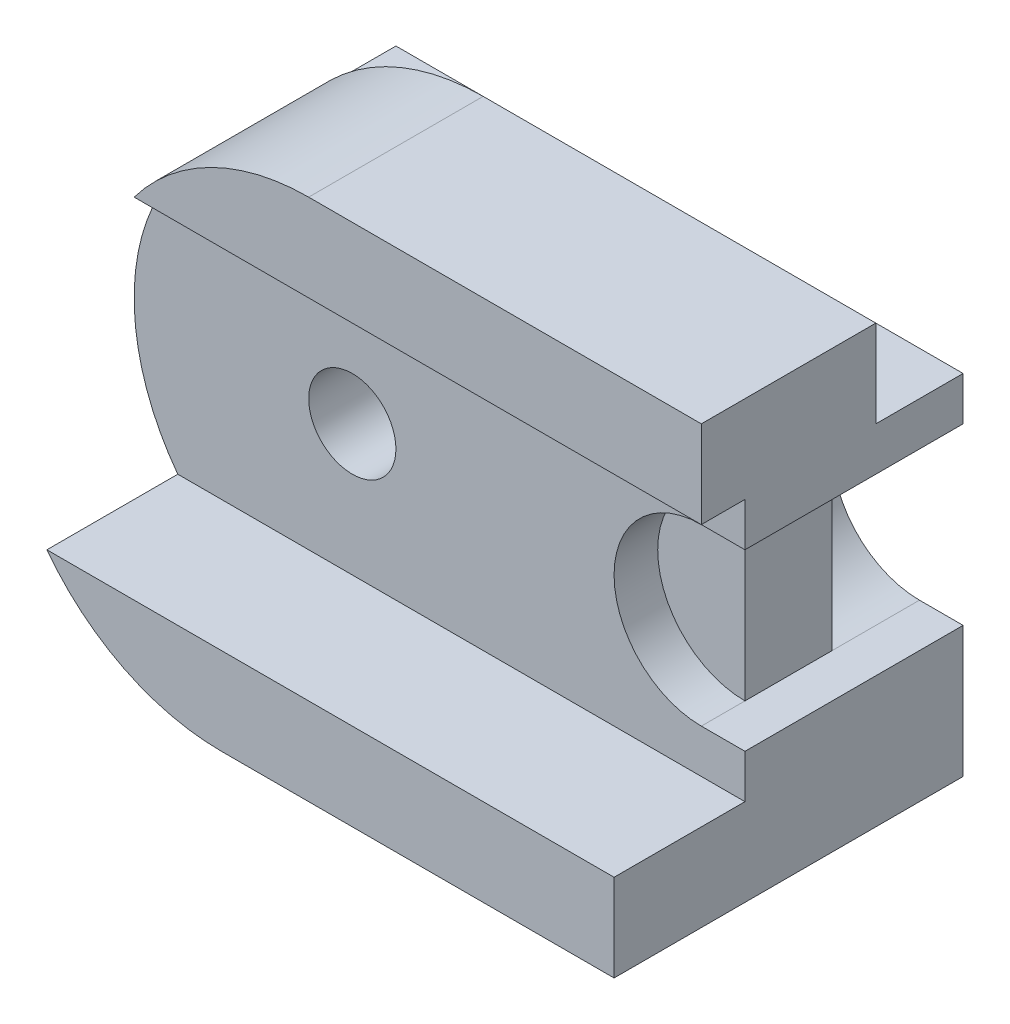
ISO-10303-21;
HEADER;
FILE_DESCRIPTION(('STEP AP214'),'2;1');
FILE_NAME('part.step','',(''),(''),'','','');
FILE_SCHEMA(('AUTOMOTIVE_DESIGN { 1 0 10303 214 1 1 1 1 }'));
ENDSEC;
DATA;
#1=APPLICATION_CONTEXT('core data for automotive mechanical design processes');
#2=APPLICATION_PROTOCOL_DEFINITION('international standard','automotive_design',2000,#1);
#3=PRODUCT_CONTEXT('',#1,'mechanical');
#4=PRODUCT('Part','Part','',(#3));
#5=PRODUCT_RELATED_PRODUCT_CATEGORY('part','',(#4));
#6=PRODUCT_DEFINITION_FORMATION('','',#4);
#7=PRODUCT_DEFINITION_CONTEXT('part definition',#1,'design');
#8=PRODUCT_DEFINITION('design','',#6,#7);
#9=PRODUCT_DEFINITION_SHAPE('','',#8);
#10=(LENGTH_UNIT() NAMED_UNIT(*) SI_UNIT(.MILLI.,.METRE.));
#11=(NAMED_UNIT(*) PLANE_ANGLE_UNIT() SI_UNIT($,.RADIAN.));
#12=(NAMED_UNIT(*) SI_UNIT($,.STERADIAN.) SOLID_ANGLE_UNIT());
#13=UNCERTAINTY_MEASURE_WITH_UNIT(LENGTH_MEASURE(1.E-05),#10,'distance_accuracy_value','');
#14=(GEOMETRIC_REPRESENTATION_CONTEXT(3) GLOBAL_UNCERTAINTY_ASSIGNED_CONTEXT((#13)) GLOBAL_UNIT_ASSIGNED_CONTEXT((#10,
#11,#12)) REPRESENTATION_CONTEXT('',''));
#15=CARTESIAN_POINT('',(0.,0.,0.));
#16=DIRECTION('',(0.,0.,1.));
#17=DIRECTION('',(1.,0.,0.));
#18=AXIS2_PLACEMENT_3D('',#15,#16,#17);
#19=CARTESIAN_POINT('',(0.,0.,0.));
#20=DIRECTION('',(0.,0.,1.));
#21=DIRECTION('',(1.,0.,0.));
#22=AXIS2_PLACEMENT_3D('',#19,#20,#21);
#23=PLANE('',#22);
#24=DIRECTION('',(1.,0.,0.));
#25=VECTOR('',#24,1.);
#26=CARTESIAN_POINT('',(0.,-49.9999,0.));
#27=LINE('',#26,#25);
#28=CARTESIAN_POINT('',(0.,-49.9999,0.));
#29=VERTEX_POINT('',#28);
#30=CARTESIAN_POINT('',(10.,-49.9999,0.));
#31=VERTEX_POINT('',#30);
#32=EDGE_CURVE('E229',#29,#31,#27,.T.);
#33=ORIENTED_EDGE('',*,*,#32,.F.);
#34=DIRECTION('',(0.,-1.,0.));
#35=VECTOR('',#34,1.);
#36=CARTESIAN_POINT('',(0.,-49.9999,0.));
#37=LINE('',#36,#35);
#38=CARTESIAN_POINT('',(0.,-50.,0.));
#39=VERTEX_POINT('',#38);
#40=EDGE_CURVE('E212',#29,#39,#37,.T.);
#41=ORIENTED_EDGE('',*,*,#40,.T.);
#42=CARTESIAN_POINT('',(0.,0.,0.));
#43=DIRECTION('',(0.,0.,1.));
#44=DIRECTION('',(1.,0.,0.));
#45=AXIS2_PLACEMENT_3D('',#42,#43,#44);
#46=CIRCLE('',#45,50.);
#47=CARTESIAN_POINT('',(-40.,30.0000000000001,0.));
#48=VERTEX_POINT('',#47);
#49=EDGE_CURVE('E391',#48,#39,#46,.T.);
#50=ORIENTED_EDGE('',*,*,#49,.F.);
#51=DIRECTION('',(1.,0.,0.));
#52=VECTOR('',#51,1.);
#53=CARTESIAN_POINT('',(0.,30.,0.));
#54=LINE('',#53,#52);
#55=CARTESIAN_POINT('',(0.000999999999959367,30.,0.));
#56=VERTEX_POINT('',#55);
#57=EDGE_CURVE('E420',#48,#56,#54,.T.);
#58=ORIENTED_EDGE('',*,*,#57,.T.);
#59=DIRECTION('',(0.,-1.,0.));
#60=VECTOR('',#59,1.);
#61=CARTESIAN_POINT('',(0.000999999999974667,0.,0.));
#62=LINE('',#61,#60);
#63=CARTESIAN_POINT('',(0.000999999999969567,9.99999995,0.));
#64=VERTEX_POINT('',#63);
#65=EDGE_CURVE('E270',#56,#64,#62,.T.);
#66=ORIENTED_EDGE('',*,*,#65,.T.);
#67=CARTESIAN_POINT('',(0.,0.,0.));
#68=DIRECTION('',(0.,0.,1.));
#69=DIRECTION('',(1.,0.,0.));
#70=AXIS2_PLACEMENT_3D('',#67,#68,#69);
#71=CIRCLE('',#70,10.);
#72=CARTESIAN_POINT('',(0.000999999999979767,-9.99999995,0.));
#73=VERTEX_POINT('',#72);
#74=EDGE_CURVE('E320',#64,#73,#71,.T.);
#75=ORIENTED_EDGE('',*,*,#74,.T.);
#76=DIRECTION('',(0.,-1.,0.));
#77=VECTOR('',#76,1.);
#78=CARTESIAN_POINT('',(0.000999999999974667,0.,0.));
#79=LINE('',#78,#77);
#80=CARTESIAN_POINT('',(0.00100000000000017,-49.9989999999999,0.));
#81=VERTEX_POINT('',#80);
#82=EDGE_CURVE('E267',#73,#81,#79,.T.);
#83=ORIENTED_EDGE('',*,*,#82,.T.);
#84=CARTESIAN_POINT('',(0.,0.,0.));
#85=DIRECTION('',(0.,0.,-1.));
#86=DIRECTION('',(-1.,0.,0.));
#87=AXIS2_PLACEMENT_3D('',#84,#85,#86);
#88=CIRCLE('',#87,49.9990000100001);
#89=CARTESIAN_POINT('',(49.9990000100001,0.,0.));
#90=VERTEX_POINT('',#89);
#91=EDGE_CURVE('E246',#81,#90,#88,.F.);
#92=ORIENTED_EDGE('',*,*,#91,.T.);
#93=DIRECTION('',(-1.,0.,0.));
#94=VECTOR('',#93,1.);
#95=CARTESIAN_POINT('',(0.,0.,0.));
#96=LINE('',#95,#94);
#97=CARTESIAN_POINT('',(50.,0.,0.));
#98=VERTEX_POINT('',#97);
#99=EDGE_CURVE('E252',#98,#90,#96,.T.);
#100=ORIENTED_EDGE('',*,*,#99,.F.);
#101=CARTESIAN_POINT('',(0.,0.,0.));
#102=DIRECTION('',(0.,0.,-1.));
#103=DIRECTION('',(-1.,0.,0.));
#104=AXIS2_PLACEMENT_3D('',#101,#102,#103);
#105=CIRCLE('',#104,50.);
#106=CARTESIAN_POINT('',(40.,30.,0.));
#107=VERTEX_POINT('',#106);
#108=EDGE_CURVE('E273',#107,#98,#105,.T.);
#109=ORIENTED_EDGE('',*,*,#108,.F.);
#110=CARTESIAN_POINT('',(90.,30.,0.));
#111=VERTEX_POINT('',#110);
#112=EDGE_CURVE('E419',#107,#111,#54,.T.);
#113=ORIENTED_EDGE('',*,*,#112,.T.);
#114=DIRECTION('',(0.,-1.,0.));
#115=VECTOR('',#114,1.);
#116=CARTESIAN_POINT('',(90.,0.,0.));
#117=LINE('',#116,#115);
#118=CARTESIAN_POINT('',(90.,20.,0.));
#119=VERTEX_POINT('',#118);
#120=EDGE_CURVE('E388',#111,#119,#117,.T.);
#121=ORIENTED_EDGE('',*,*,#120,.T.);
#122=DIRECTION('',(-1.,0.,0.));
#123=VECTOR('',#122,1.);
#124=CARTESIAN_POINT('',(0.,20.,0.));
#125=LINE('',#124,#123);
#126=CARTESIAN_POINT('',(80.,20.,0.));
#127=VERTEX_POINT('',#126);
#128=EDGE_CURVE('E376',#119,#127,#125,.T.);
#129=ORIENTED_EDGE('',*,*,#128,.T.);
#130=CARTESIAN_POINT('',(80.,0.,0.));
#131=DIRECTION('',(0.,0.,-1.));
#132=DIRECTION('',(1.,0.,0.));
#133=AXIS2_PLACEMENT_3D('',#130,#131,#132);
#134=CIRCLE('',#133,20.);
#135=CARTESIAN_POINT('',(80.,-20.,0.));
#136=VERTEX_POINT('',#135);
#137=EDGE_CURVE('E280',#136,#127,#134,.T.);
#138=ORIENTED_EDGE('',*,*,#137,.F.);
#139=DIRECTION('',(-1.,0.,0.));
#140=VECTOR('',#139,1.);
#141=CARTESIAN_POINT('',(0.,-20.,0.));
#142=LINE('',#141,#140);
#143=CARTESIAN_POINT('',(90.,-20.,0.));
#144=VERTEX_POINT('',#143);
#145=EDGE_CURVE('E380',#144,#136,#142,.T.);
#146=ORIENTED_EDGE('',*,*,#145,.F.);
#147=DIRECTION('',(0.,-1.,0.));
#148=VECTOR('',#147,1.);
#149=CARTESIAN_POINT('',(90.,0.,0.));
#150=LINE('',#149,#148);
#151=CARTESIAN_POINT('',(90.,-50.,0.));
#152=VERTEX_POINT('',#151);
#153=EDGE_CURVE('E395',#144,#152,#150,.T.);
#154=ORIENTED_EDGE('',*,*,#153,.T.);
#155=DIRECTION('',(1.,0.,0.));
#156=VECTOR('',#155,1.);
#157=CARTESIAN_POINT('',(0.,-50.,0.));
#158=LINE('',#157,#156);
#159=CARTESIAN_POINT('',(10.,-50.,0.));
#160=VERTEX_POINT('',#159);
#161=EDGE_CURVE('E393',#160,#152,#158,.T.);
#162=ORIENTED_EDGE('',*,*,#161,.F.);
#163=DIRECTION('',(0.,-1.,0.));
#164=VECTOR('',#163,1.);
#165=CARTESIAN_POINT('',(10.,-49.9999,0.));
#166=LINE('',#165,#164);
#167=EDGE_CURVE('E50',#31,#160,#166,.T.);
#168=ORIENTED_EDGE('',*,*,#167,.F.);
#169=EDGE_LOOP('',(#33,#41,#50,#58,#66,#75,#83,#92,#100,#109,#113,#121,#129,#138,#146,#154,#162,#168));
#170=FACE_BOUND('',#169,.T.);
#171=ADVANCED_FACE('F35',(#170),#23,.F.);
#172=CARTESIAN_POINT('',(-115.,30.0000000000001,0.));
#173=DIRECTION('',(0.,-1.,0.));
#174=DIRECTION('',(1.,0.,0.));
#175=AXIS2_PLACEMENT_3D('',#172,#173,#174);
#176=PLANE('',#175);
#177=DIRECTION('',(0.,0.,-1.));
#178=VECTOR('',#177,1.);
#179=CARTESIAN_POINT('',(0.000999999999959367,30.,20.));
#180=LINE('',#179,#178);
#181=CARTESIAN_POINT('',(0.000999999999959367,30.,20.));
#182=VERTEX_POINT('',#181);
#183=EDGE_CURVE('E285',#182,#56,#180,.T.);
#184=ORIENTED_EDGE('',*,*,#183,.T.);
#185=ORIENTED_EDGE('',*,*,#57,.F.);
#186=DIRECTION('',(0.,0.,-1.));
#187=VECTOR('',#186,1.);
#188=CARTESIAN_POINT('',(-40.,30.,80.));
#189=LINE('',#188,#187);
#190=CARTESIAN_POINT('',(-40.,30.0000000000001,20.));
#191=VERTEX_POINT('',#190);
#192=EDGE_CURVE('E370',#191,#48,#189,.T.);
#193=ORIENTED_EDGE('',*,*,#192,.F.);
#194=DIRECTION('',(1.,0.,0.));
#195=VECTOR('',#194,1.);
#196=CARTESIAN_POINT('',(-115.,30.0000000000001,20.));
#197=LINE('',#196,#195);
#198=EDGE_CURVE('E367',#191,#182,#197,.T.);
#199=ORIENTED_EDGE('',*,*,#198,.T.);
#200=EDGE_LOOP('',(#184,#185,#193,#199));
#201=FACE_BOUND('',#200,.T.);
#202=ADVANCED_FACE('F497',(#201),#176,.F.);
#203=CARTESIAN_POINT('',(0.,0.,-100.));
#204=DIRECTION('',(0.,0.,1.));
#205=DIRECTION('',(1.,0.,0.));
#206=AXIS2_PLACEMENT_3D('',#203,#204,#205);
#207=CYLINDRICAL_SURFACE('',#206,10.);
#208=CARTESIAN_POINT('',(0.,0.,50.));
#209=DIRECTION('',(0.,0.,1.));
#210=DIRECTION('',(1.,0.,0.));
#211=AXIS2_PLACEMENT_3D('',#208,#209,#210);
#212=CIRCLE('',#211,10.);
#213=CARTESIAN_POINT('',(10.,0.,50.));
#214=VERTEX_POINT('',#213);
#215=EDGE_CURVE('E315',#214,#214,#212,.T.);
#216=ORIENTED_EDGE('',*,*,#215,.T.);
#217=EDGE_LOOP('',(#216));
#218=FACE_BOUND('',#217,.T.);
#219=DIRECTION('',(0.,0.,-1.));
#220=VECTOR('',#219,1.);
#221=CARTESIAN_POINT('',(0.000999999999969567,9.99999995,20.));
#222=LINE('',#221,#220);
#223=CARTESIAN_POINT('',(0.000999999999969567,9.99999995,20.));
#224=VERTEX_POINT('',#223);
#225=EDGE_CURVE('E288',#224,#64,#222,.T.);
#226=ORIENTED_EDGE('',*,*,#225,.F.);
#227=CARTESIAN_POINT('',(0.,0.,20.));
#228=DIRECTION('',(0.,0.,-1.));
#229=DIRECTION('',(-1.,0.,0.));
#230=AXIS2_PLACEMENT_3D('',#227,#228,#229);
#231=CIRCLE('',#230,10.);
#232=CARTESIAN_POINT('',(0.000999999999979767,-9.99999995,20.));
#233=VERTEX_POINT('',#232);
#234=EDGE_CURVE('E254',#233,#224,#231,.F.);
#235=ORIENTED_EDGE('',*,*,#234,.F.);
#236=DIRECTION('',(0.,0.,-1.));
#237=VECTOR('',#236,1.);
#238=CARTESIAN_POINT('',(0.000999999999979767,-9.99999995,20.));
#239=LINE('',#238,#237);
#240=EDGE_CURVE('E290',#233,#73,#239,.T.);
#241=ORIENTED_EDGE('',*,*,#240,.T.);
#242=ORIENTED_EDGE('',*,*,#74,.F.);
#243=EDGE_LOOP('',(#226,#235,#241,#242));
#244=FACE_BOUND('',#243,.T.);
#245=ADVANCED_FACE('F502',(#218,#244),#207,.F.);
#246=CARTESIAN_POINT('',(80.,0.,80.));
#247=DIRECTION('',(0.,0.,-1.));
#248=DIRECTION('',(-1.,0.,0.));
#249=AXIS2_PLACEMENT_3D('',#246,#247,#248);
#250=CYLINDRICAL_SURFACE('',#249,20.);
#251=CARTESIAN_POINT('',(80.,0.,40.));
#252=DIRECTION('',(0.,0.,-1.));
#253=DIRECTION('',(1.,0.,0.));
#254=AXIS2_PLACEMENT_3D('',#251,#252,#253);
#255=CIRCLE('',#254,20.);
#256=CARTESIAN_POINT('',(80.,-20.,40.));
#257=VERTEX_POINT('',#256);
#258=CARTESIAN_POINT('',(80.,20.,40.));
#259=VERTEX_POINT('',#258);
#260=EDGE_CURVE('E303',#257,#259,#255,.T.);
#261=ORIENTED_EDGE('',*,*,#260,.T.);
#262=DIRECTION('',(0.,0.,-1.));
#263=VECTOR('',#262,1.);
#264=CARTESIAN_POINT('',(80.,20.,80.));
#265=LINE('',#264,#263);
#266=CARTESIAN_POINT('',(80.,20.,50.));
#267=VERTEX_POINT('',#266);
#268=EDGE_CURVE('E416',#267,#259,#265,.T.);
#269=ORIENTED_EDGE('',*,*,#268,.F.);
#270=CARTESIAN_POINT('',(80.,0.,50.));
#271=DIRECTION('',(0.,0.,1.));
#272=DIRECTION('',(0.,-1.,0.));
#273=AXIS2_PLACEMENT_3D('',#270,#271,#272);
#274=CIRCLE('',#273,20.);
#275=CARTESIAN_POINT('',(80.,-20.,50.));
#276=VERTEX_POINT('',#275);
#277=EDGE_CURVE('E349',#267,#276,#274,.T.);
#278=ORIENTED_EDGE('',*,*,#277,.T.);
#279=DIRECTION('',(0.,0.,-1.));
#280=VECTOR('',#279,1.);
#281=CARTESIAN_POINT('',(80.,-20.,80.));
#282=LINE('',#281,#280);
#283=EDGE_CURVE('E385',#276,#257,#282,.T.);
#284=ORIENTED_EDGE('',*,*,#283,.T.);
#285=EDGE_LOOP('',(#261,#269,#278,#284));
#286=FACE_BOUND('',#285,.T.);
#287=ADVANCED_FACE('F37',(#286),#250,.F.);
#288=CARTESIAN_POINT('',(0.,20.,80.));
#289=DIRECTION('',(0.,-1.,0.));
#290=DIRECTION('',(0.,0.,-1.));
#291=AXIS2_PLACEMENT_3D('',#288,#289,#290);
#292=PLANE('',#291);
#293=DIRECTION('',(0.,0.,-1.));
#294=VECTOR('',#293,1.);
#295=CARTESIAN_POINT('',(90.,20.,80.));
#296=LINE('',#295,#294);
#297=CARTESIAN_POINT('',(90.,20.,50.));
#298=VERTEX_POINT('',#297);
#299=EDGE_CURVE('E414',#298,#119,#296,.T.);
#300=ORIENTED_EDGE('',*,*,#299,.F.);
#301=DIRECTION('',(-1.,0.,0.));
#302=VECTOR('',#301,1.);
#303=CARTESIAN_POINT('',(0.,20.,50.));
#304=LINE('',#303,#302);
#305=EDGE_CURVE('E352',#298,#267,#304,.T.);
#306=ORIENTED_EDGE('',*,*,#305,.T.);
#307=ORIENTED_EDGE('',*,*,#268,.T.);
#308=DIRECTION('',(0.,0.,-1.));
#309=VECTOR('',#308,1.);
#310=CARTESIAN_POINT('',(80.,20.,40.));
#311=LINE('',#310,#309);
#312=CARTESIAN_POINT('',(80.,20.,20.));
#313=VERTEX_POINT('',#312);
#314=EDGE_CURVE('E311',#259,#313,#311,.T.);
#315=ORIENTED_EDGE('',*,*,#314,.T.);
#316=DIRECTION('',(0.,0.,-1.));
#317=VECTOR('',#316,1.);
#318=CARTESIAN_POINT('',(80.,20.,20.));
#319=LINE('',#318,#317);
#320=EDGE_CURVE('E299',#313,#127,#319,.T.);
#321=ORIENTED_EDGE('',*,*,#320,.T.);
#322=ORIENTED_EDGE('',*,*,#128,.F.);
#323=EDGE_LOOP('',(#300,#306,#307,#315,#321,#322));
#324=FACE_BOUND('',#323,.T.);
#325=ADVANCED_FACE('F448',(#324),#292,.T.);
#326=CARTESIAN_POINT('',(90.,0.,80.));
#327=DIRECTION('',(1.,0.,0.));
#328=DIRECTION('',(0.,1.,0.));
#329=AXIS2_PLACEMENT_3D('',#326,#327,#328);
#330=PLANE('',#329);
#331=DIRECTION('',(0.,1.,0.));
#332=VECTOR('',#331,1.);
#333=CARTESIAN_POINT('',(90.,50.,60.));
#334=LINE('',#333,#332);
#335=CARTESIAN_POINT('',(90.,30.,60.));
#336=VERTEX_POINT('',#335);
#337=CARTESIAN_POINT('',(90.,50.,60.));
#338=VERTEX_POINT('',#337);
#339=EDGE_CURVE('E323',#336,#338,#334,.T.);
#340=ORIENTED_EDGE('',*,*,#339,.F.);
#341=DIRECTION('',(0.,0.,-1.));
#342=VECTOR('',#341,1.);
#343=CARTESIAN_POINT('',(90.,30.,80.));
#344=LINE('',#343,#342);
#345=CARTESIAN_POINT('',(90.,30.,50.));
#346=VERTEX_POINT('',#345);
#347=EDGE_CURVE('E339',#336,#346,#344,.T.);
#348=ORIENTED_EDGE('',*,*,#347,.T.);
#349=DIRECTION('',(0.,-1.,0.));
#350=VECTOR('',#349,1.);
#351=CARTESIAN_POINT('',(90.,0.,50.));
#352=LINE('',#351,#350);
#353=EDGE_CURVE('E355',#346,#298,#352,.T.);
#354=ORIENTED_EDGE('',*,*,#353,.T.);
#355=ORIENTED_EDGE('',*,*,#299,.T.);
#356=ORIENTED_EDGE('',*,*,#120,.F.);
#357=DIRECTION('',(0.,0.,-1.));
#358=VECTOR('',#357,1.);
#359=CARTESIAN_POINT('',(90.,30.,0.));
#360=LINE('',#359,#358);
#361=CARTESIAN_POINT('',(90.,30.,20.));
#362=VERTEX_POINT('',#361);
#363=EDGE_CURVE('E363',#362,#111,#360,.T.);
#364=ORIENTED_EDGE('',*,*,#363,.F.);
#365=DIRECTION('',(0.,-1.,0.));
#366=VECTOR('',#365,1.);
#367=CARTESIAN_POINT('',(90.,50.,20.));
#368=LINE('',#367,#366);
#369=CARTESIAN_POINT('',(90.,50.,20.));
#370=VERTEX_POINT('',#369);
#371=EDGE_CURVE('E360',#370,#362,#368,.T.);
#372=ORIENTED_EDGE('',*,*,#371,.F.);
#373=DIRECTION('',(0.,0.,-1.));
#374=VECTOR('',#373,1.);
#375=CARTESIAN_POINT('',(90.,50.,80.));
#376=LINE('',#375,#374);
#377=EDGE_CURVE('E412',#338,#370,#376,.T.);
#378=ORIENTED_EDGE('',*,*,#377,.F.);
#379=EDGE_LOOP('',(#340,#348,#354,#355,#356,#364,#372,#378));
#380=FACE_BOUND('',#379,.T.);
#381=ADVANCED_FACE('F454',(#380),#330,.T.);
#382=CARTESIAN_POINT('',(0.,0.,80.));
#383=DIRECTION('',(0.,0.,-1.));
#384=DIRECTION('',(-1.,0.,0.));
#385=AXIS2_PLACEMENT_3D('',#382,#383,#384);
#386=CYLINDRICAL_SURFACE('',#385,50.);
#387=DIRECTION('',(0.,0.,-1.));
#388=VECTOR('',#387,1.);
#389=CARTESIAN_POINT('',(-40.,30.,80.));
#390=LINE('',#389,#388);
#391=CARTESIAN_POINT('',(-40.,30.,60.));
#392=VERTEX_POINT('',#391);
#393=CARTESIAN_POINT('',(-40.,30.,50.));
#394=VERTEX_POINT('',#393);
#395=EDGE_CURVE('E337',#392,#394,#390,.T.);
#396=ORIENTED_EDGE('',*,*,#395,.F.);
#397=CARTESIAN_POINT('',(0.,0.,60.));
#398=DIRECTION('',(0.,0.,-1.));
#399=DIRECTION('',(-1.,0.,0.));
#400=AXIS2_PLACEMENT_3D('',#397,#398,#399);
#401=CIRCLE('',#400,50.);
#402=CARTESIAN_POINT('',(0.,50.,60.));
#403=VERTEX_POINT('',#402);
#404=EDGE_CURVE('E328',#392,#403,#401,.T.);
#405=ORIENTED_EDGE('',*,*,#404,.T.);
#406=DIRECTION('',(0.,0.,-1.));
#407=VECTOR('',#406,1.);
#408=CARTESIAN_POINT('',(0.,50.,80.));
#409=LINE('',#408,#407);
#410=CARTESIAN_POINT('',(0.,50.,20.));
#411=VERTEX_POINT('',#410);
#412=EDGE_CURVE('E410',#403,#411,#409,.T.);
#413=ORIENTED_EDGE('',*,*,#412,.T.);
#414=CARTESIAN_POINT('',(0.,0.,20.));
#415=DIRECTION('',(0.,0.,1.));
#416=DIRECTION('',(0.,-1.,0.));
#417=AXIS2_PLACEMENT_3D('',#414,#415,#416);
#418=CIRCLE('',#417,50.);
#419=EDGE_CURVE('E423',#411,#191,#418,.T.);
#420=ORIENTED_EDGE('',*,*,#419,.T.);
#421=ORIENTED_EDGE('',*,*,#192,.T.);
#422=ORIENTED_EDGE('',*,*,#49,.T.);
#423=DIRECTION('',(0.,0.,-1.));
#424=VECTOR('',#423,1.);
#425=CARTESIAN_POINT('',(0.,-50.,0.));
#426=LINE('',#425,#424);
#427=CARTESIAN_POINT('',(0.,-50.,20.));
#428=VERTEX_POINT('',#427);
#429=EDGE_CURVE('E218',#428,#39,#426,.T.);
#430=ORIENTED_EDGE('',*,*,#429,.F.);
#431=DIRECTION('',(0.,0.,-1.));
#432=VECTOR('',#431,1.);
#433=CARTESIAN_POINT('',(0.,-50.,80.));
#434=LINE('',#433,#432);
#435=CARTESIAN_POINT('',(0.,-50.,80.));
#436=VERTEX_POINT('',#435);
#437=EDGE_CURVE('E407',#436,#428,#434,.T.);
#438=ORIENTED_EDGE('',*,*,#437,.F.);
#439=CARTESIAN_POINT('',(0.,0.,80.));
#440=DIRECTION('',(0.,0.,1.));
#441=DIRECTION('',(1.,0.,0.));
#442=AXIS2_PLACEMENT_3D('',#439,#440,#441);
#443=CIRCLE('',#442,50.);
#444=CARTESIAN_POINT('',(-40.,-30.,80.));
#445=VERTEX_POINT('',#444);
#446=EDGE_CURVE('E377',#445,#436,#443,.T.);
#447=ORIENTED_EDGE('',*,*,#446,.F.);
#448=DIRECTION('',(0.,0.,-1.));
#449=VECTOR('',#448,1.);
#450=CARTESIAN_POINT('',(-40.,-30.,80.));
#451=LINE('',#450,#449);
#452=CARTESIAN_POINT('',(-40.,-30.,50.));
#453=VERTEX_POINT('',#452);
#454=EDGE_CURVE('E344',#453,#445,#451,.F.);
#455=ORIENTED_EDGE('',*,*,#454,.F.);
#456=CARTESIAN_POINT('',(0.,0.,50.));
#457=DIRECTION('',(0.,0.,1.));
#458=DIRECTION('',(0.,-1.,0.));
#459=AXIS2_PLACEMENT_3D('',#456,#457,#458);
#460=CIRCLE('',#459,50.);
#461=EDGE_CURVE('E358',#394,#453,#460,.T.);
#462=ORIENTED_EDGE('',*,*,#461,.F.);
#463=EDGE_LOOP('',(#396,#405,#413,#420,#421,#422,#430,#438,#447,#455,#462));
#464=FACE_BOUND('',#463,.T.);
#465=ADVANCED_FACE('F465',(#464),#386,.T.);
#466=CARTESIAN_POINT('',(90.,0.,80.));
#467=DIRECTION('',(1.,0.,0.));
#468=DIRECTION('',(0.,1.,0.));
#469=AXIS2_PLACEMENT_3D('',#466,#467,#468);
#470=PLANE('',#469);
#471=DIRECTION('',(0.,-1.,0.));
#472=VECTOR('',#471,1.);
#473=CARTESIAN_POINT('',(90.,0.,50.));
#474=LINE('',#473,#472);
#475=CARTESIAN_POINT('',(90.,-20.,50.));
#476=VERTEX_POINT('',#475);
#477=CARTESIAN_POINT('',(90.,-30.,50.));
#478=VERTEX_POINT('',#477);
#479=EDGE_CURVE('E346',#476,#478,#474,.T.);
#480=ORIENTED_EDGE('',*,*,#479,.T.);
#481=DIRECTION('',(0.,0.,1.));
#482=VECTOR('',#481,1.);
#483=CARTESIAN_POINT('',(90.,-30.,80.));
#484=LINE('',#483,#482);
#485=CARTESIAN_POINT('',(90.,-30.,80.));
#486=VERTEX_POINT('',#485);
#487=EDGE_CURVE('E341',#478,#486,#484,.T.);
#488=ORIENTED_EDGE('',*,*,#487,.T.);
#489=DIRECTION('',(0.,-1.,0.));
#490=VECTOR('',#489,1.);
#491=CARTESIAN_POINT('',(90.,0.,80.));
#492=LINE('',#491,#490);
#493=CARTESIAN_POINT('',(90.,-50.,80.));
#494=VERTEX_POINT('',#493);
#495=EDGE_CURVE('E383',#486,#494,#492,.T.);
#496=ORIENTED_EDGE('',*,*,#495,.T.);
#497=DIRECTION('',(0.,0.,-1.));
#498=VECTOR('',#497,1.);
#499=CARTESIAN_POINT('',(90.,-50.,80.));
#500=LINE('',#499,#498);
#501=EDGE_CURVE('E404',#494,#152,#500,.T.);
#502=ORIENTED_EDGE('',*,*,#501,.T.);
#503=ORIENTED_EDGE('',*,*,#153,.F.);
#504=DIRECTION('',(0.,0.,-1.));
#505=VECTOR('',#504,1.);
#506=CARTESIAN_POINT('',(90.,-20.,80.));
#507=LINE('',#506,#505);
#508=EDGE_CURVE('E402',#476,#144,#507,.T.);
#509=ORIENTED_EDGE('',*,*,#508,.F.);
#510=EDGE_LOOP('',(#480,#488,#496,#502,#503,#509));
#511=FACE_BOUND('',#510,.T.);
#512=ADVANCED_FACE('F476',(#511),#470,.T.);
#513=CARTESIAN_POINT('',(0.,-20.,80.));
#514=DIRECTION('',(0.,-1.,0.));
#515=DIRECTION('',(0.,0.,-1.));
#516=AXIS2_PLACEMENT_3D('',#513,#514,#515);
#517=PLANE('',#516);
#518=DIRECTION('',(-1.,0.,0.));
#519=VECTOR('',#518,1.);
#520=CARTESIAN_POINT('',(0.,-20.,50.));
#521=LINE('',#520,#519);
#522=EDGE_CURVE('E43',#476,#276,#521,.T.);
#523=ORIENTED_EDGE('',*,*,#522,.F.);
#524=ORIENTED_EDGE('',*,*,#508,.T.);
#525=ORIENTED_EDGE('',*,*,#145,.T.);
#526=DIRECTION('',(0.,0.,-1.));
#527=VECTOR('',#526,1.);
#528=CARTESIAN_POINT('',(80.,-20.,20.));
#529=LINE('',#528,#527);
#530=CARTESIAN_POINT('',(80.,-20.,20.));
#531=VERTEX_POINT('',#530);
#532=EDGE_CURVE('E301',#531,#136,#529,.T.);
#533=ORIENTED_EDGE('',*,*,#532,.F.);
#534=DIRECTION('',(0.,0.,-1.));
#535=VECTOR('',#534,1.);
#536=CARTESIAN_POINT('',(80.,-20.,40.));
#537=LINE('',#536,#535);
#538=EDGE_CURVE('E312',#257,#531,#537,.T.);
#539=ORIENTED_EDGE('',*,*,#538,.F.);
#540=ORIENTED_EDGE('',*,*,#283,.F.);
#541=EDGE_LOOP('',(#523,#524,#525,#533,#539,#540));
#542=FACE_BOUND('',#541,.T.);
#543=ADVANCED_FACE('F438',(#542),#517,.F.);
#544=CARTESIAN_POINT('',(0.,0.,80.));
#545=DIRECTION('',(0.,0.,1.));
#546=DIRECTION('',(1.,0.,0.));
#547=AXIS2_PLACEMENT_3D('',#544,#545,#546);
#548=PLANE('',#547);
#549=ORIENTED_EDGE('',*,*,#495,.F.);
#550=DIRECTION('',(-1.,0.,0.));
#551=VECTOR('',#550,1.);
#552=CARTESIAN_POINT('',(0.,-30.,80.));
#553=LINE('',#552,#551);
#554=EDGE_CURVE('E426',#486,#445,#553,.T.);
#555=ORIENTED_EDGE('',*,*,#554,.T.);
#556=ORIENTED_EDGE('',*,*,#446,.T.);
#557=DIRECTION('',(1.,0.,0.));
#558=VECTOR('',#557,1.);
#559=CARTESIAN_POINT('',(0.,-50.,80.));
#560=LINE('',#559,#558);
#561=EDGE_CURVE('E379',#436,#494,#560,.T.);
#562=ORIENTED_EDGE('',*,*,#561,.T.);
#563=EDGE_LOOP('',(#549,#555,#556,#562));
#564=FACE_BOUND('',#563,.T.);
#565=ADVANCED_FACE('F472',(#564),#548,.T.);
#566=CARTESIAN_POINT('',(0.,50.,80.));
#567=DIRECTION('',(0.,1.,0.));
#568=DIRECTION('',(0.,0.,1.));
#569=AXIS2_PLACEMENT_3D('',#566,#567,#568);
#570=PLANE('',#569);
#571=DIRECTION('',(1.,0.,0.));
#572=VECTOR('',#571,1.);
#573=CARTESIAN_POINT('',(-60.,50.0000000000001,60.));
#574=LINE('',#573,#572);
#575=EDGE_CURVE('E325',#403,#338,#574,.T.);
#576=ORIENTED_EDGE('',*,*,#575,.T.);
#577=ORIENTED_EDGE('',*,*,#377,.T.);
#578=DIRECTION('',(1.,0.,0.));
#579=VECTOR('',#578,1.);
#580=CARTESIAN_POINT('',(-115.,50.0000000000001,20.));
#581=LINE('',#580,#579);
#582=EDGE_CURVE('E366',#411,#370,#581,.T.);
#583=ORIENTED_EDGE('',*,*,#582,.F.);
#584=ORIENTED_EDGE('',*,*,#412,.F.);
#585=EDGE_LOOP('',(#576,#577,#583,#584));
#586=FACE_BOUND('',#585,.T.);
#587=ADVANCED_FACE('F517',(#586),#570,.T.);
#588=CARTESIAN_POINT('',(0.,-50.,80.));
#589=DIRECTION('',(0.,1.,0.));
#590=DIRECTION('',(0.,0.,1.));
#591=AXIS2_PLACEMENT_3D('',#588,#589,#590);
#592=PLANE('',#591);
#593=ORIENTED_EDGE('',*,*,#437,.T.);
#594=DIRECTION('',(-1.,0.,0.));
#595=VECTOR('',#594,1.);
#596=CARTESIAN_POINT('',(0.,-50.,20.));
#597=LINE('',#596,#595);
#598=CARTESIAN_POINT('',(10.,-50.,20.));
#599=VERTEX_POINT('',#598);
#600=EDGE_CURVE('E231',#599,#428,#597,.T.);
#601=ORIENTED_EDGE('',*,*,#600,.F.);
#602=DIRECTION('',(0.,0.,1.));
#603=VECTOR('',#602,1.);
#604=CARTESIAN_POINT('',(10.,-50.,0.));
#605=LINE('',#604,#603);
#606=EDGE_CURVE('E240',#160,#599,#605,.T.);
#607=ORIENTED_EDGE('',*,*,#606,.F.);
#608=ORIENTED_EDGE('',*,*,#161,.T.);
#609=ORIENTED_EDGE('',*,*,#501,.F.);
#610=ORIENTED_EDGE('',*,*,#561,.F.);
#611=EDGE_LOOP('',(#593,#601,#607,#608,#609,#610));
#612=FACE_BOUND('',#611,.T.);
#613=ADVANCED_FACE('F513',(#612),#592,.F.);
#614=CARTESIAN_POINT('',(-115.,50.0000000000001,20.));
#615=DIRECTION('',(0.,0.,1.));
#616=DIRECTION('',(0.,-1.,0.));
#617=AXIS2_PLACEMENT_3D('',#614,#615,#616);
#618=PLANE('',#617);
#619=ORIENTED_EDGE('',*,*,#582,.T.);
#620=ORIENTED_EDGE('',*,*,#371,.T.);
#621=CARTESIAN_POINT('',(40.,30.,20.));
#622=VERTEX_POINT('',#621);
#623=EDGE_CURVE('E371',#622,#362,#197,.T.);
#624=ORIENTED_EDGE('',*,*,#623,.F.);
#625=CARTESIAN_POINT('',(0.,0.,20.));
#626=DIRECTION('',(0.,0.,-1.));
#627=DIRECTION('',(-1.,0.,0.));
#628=AXIS2_PLACEMENT_3D('',#625,#626,#627);
#629=CIRCLE('',#628,50.);
#630=CARTESIAN_POINT('',(50.,0.,20.));
#631=VERTEX_POINT('',#630);
#632=EDGE_CURVE('E258',#622,#631,#629,.T.);
#633=ORIENTED_EDGE('',*,*,#632,.T.);
#634=DIRECTION('',(-1.,0.,0.));
#635=VECTOR('',#634,1.);
#636=CARTESIAN_POINT('',(0.,0.,20.));
#637=LINE('',#636,#635);
#638=CARTESIAN_POINT('',(49.9990000100001,0.,20.));
#639=VERTEX_POINT('',#638);
#640=EDGE_CURVE('E261',#631,#639,#637,.T.);
#641=ORIENTED_EDGE('',*,*,#640,.T.);
#642=CARTESIAN_POINT('',(0.,0.,20.));
#643=DIRECTION('',(0.,0.,-1.));
#644=DIRECTION('',(-1.,0.,0.));
#645=AXIS2_PLACEMENT_3D('',#642,#643,#644);
#646=CIRCLE('',#645,49.9990000100001);
#647=CARTESIAN_POINT('',(0.00100000000000017,-49.9989999999999,20.));
#648=VERTEX_POINT('',#647);
#649=EDGE_CURVE('E250',#648,#639,#646,.F.);
#650=ORIENTED_EDGE('',*,*,#649,.F.);
#651=DIRECTION('',(0.,-1.,0.));
#652=VECTOR('',#651,1.);
#653=CARTESIAN_POINT('',(0.000999999999974667,0.,20.));
#654=LINE('',#653,#652);
#655=EDGE_CURVE('E58',#233,#648,#654,.T.);
#656=ORIENTED_EDGE('',*,*,#655,.F.);
#657=ORIENTED_EDGE('',*,*,#234,.T.);
#658=DIRECTION('',(0.,-1.,0.));
#659=VECTOR('',#658,1.);
#660=CARTESIAN_POINT('',(0.000999999999974667,0.,20.));
#661=LINE('',#660,#659);
#662=EDGE_CURVE('E256',#182,#224,#661,.T.);
#663=ORIENTED_EDGE('',*,*,#662,.F.);
#664=ORIENTED_EDGE('',*,*,#198,.F.);
#665=ORIENTED_EDGE('',*,*,#419,.F.);
#666=EDGE_LOOP('',(#619,#620,#624,#633,#641,#650,#656,#657,#663,#664,#665));
#667=FACE_BOUND('',#666,.T.);
#668=ADVANCED_FACE('F516',(#667),#618,.F.);
#669=ORIENTED_EDGE('',*,*,#112,.F.);
#670=DIRECTION('',(0.,0.,-1.));
#671=VECTOR('',#670,1.);
#672=CARTESIAN_POINT('',(40.,30.,20.));
#673=LINE('',#672,#671);
#674=EDGE_CURVE('E283',#622,#107,#673,.T.);
#675=ORIENTED_EDGE('',*,*,#674,.F.);
#676=ORIENTED_EDGE('',*,*,#623,.T.);
#677=ORIENTED_EDGE('',*,*,#363,.T.);
#678=EDGE_LOOP('',(#669,#675,#676,#677));
#679=FACE_BOUND('',#678,.T.);
#680=ADVANCED_FACE('F505',(#679),#176,.F.);
#681=CARTESIAN_POINT('',(155.,30.,50.));
#682=DIRECTION('',(0.,0.,1.));
#683=DIRECTION('',(0.,-1.,0.));
#684=AXIS2_PLACEMENT_3D('',#681,#682,#683);
#685=PLANE('',#684);
#686=ORIENTED_EDGE('',*,*,#215,.F.);
#687=EDGE_LOOP('',(#686));
#688=FACE_BOUND('',#687,.T.);
#689=ORIENTED_EDGE('',*,*,#461,.T.);
#690=DIRECTION('',(-1.,0.,0.));
#691=VECTOR('',#690,1.);
#692=CARTESIAN_POINT('',(155.,-30.,50.));
#693=LINE('',#692,#691);
#694=EDGE_CURVE('E334',#478,#453,#693,.T.);
#695=ORIENTED_EDGE('',*,*,#694,.F.);
#696=ORIENTED_EDGE('',*,*,#479,.F.);
#697=ORIENTED_EDGE('',*,*,#522,.T.);
#698=ORIENTED_EDGE('',*,*,#277,.F.);
#699=ORIENTED_EDGE('',*,*,#305,.F.);
#700=ORIENTED_EDGE('',*,*,#353,.F.);
#701=DIRECTION('',(-1.,0.,0.));
#702=VECTOR('',#701,1.);
#703=CARTESIAN_POINT('',(155.,30.,50.));
#704=LINE('',#703,#702);
#705=EDGE_CURVE('E331',#346,#394,#704,.T.);
#706=ORIENTED_EDGE('',*,*,#705,.T.);
#707=EDGE_LOOP('',(#689,#695,#696,#697,#698,#699,#700,#706));
#708=FACE_BOUND('',#707,.T.);
#709=ADVANCED_FACE('F430',(#688,#708),#685,.T.);
#710=CARTESIAN_POINT('',(155.,-30.,80.));
#711=DIRECTION('',(0.,1.,0.));
#712=DIRECTION('',(0.,0.,1.));
#713=AXIS2_PLACEMENT_3D('',#710,#711,#712);
#714=PLANE('',#713);
#715=ORIENTED_EDGE('',*,*,#454,.T.);
#716=ORIENTED_EDGE('',*,*,#554,.F.);
#717=ORIENTED_EDGE('',*,*,#487,.F.);
#718=ORIENTED_EDGE('',*,*,#694,.T.);
#719=EDGE_LOOP('',(#715,#716,#717,#718));
#720=FACE_BOUND('',#719,.T.);
#721=ADVANCED_FACE('F469',(#720),#714,.T.);
#722=CARTESIAN_POINT('',(155.,30.,80.));
#723=DIRECTION('',(0.,-1.,0.));
#724=DIRECTION('',(0.,0.,-1.));
#725=AXIS2_PLACEMENT_3D('',#722,#723,#724);
#726=PLANE('',#725);
#727=DIRECTION('',(1.,0.,0.));
#728=VECTOR('',#727,1.);
#729=CARTESIAN_POINT('',(155.,30.,60.));
#730=LINE('',#729,#728);
#731=EDGE_CURVE('E11',#392,#336,#730,.T.);
#732=ORIENTED_EDGE('',*,*,#731,.F.);
#733=ORIENTED_EDGE('',*,*,#395,.T.);
#734=ORIENTED_EDGE('',*,*,#705,.F.);
#735=ORIENTED_EDGE('',*,*,#347,.F.);
#736=EDGE_LOOP('',(#732,#733,#734,#735));
#737=FACE_BOUND('',#736,.T.);
#738=ADVANCED_FACE('F460',(#737),#726,.T.);
#739=CARTESIAN_POINT('',(-60.,50.0000000000001,60.));
#740=DIRECTION('',(0.,0.,-1.));
#741=DIRECTION('',(-1.,0.,0.));
#742=AXIS2_PLACEMENT_3D('',#739,#740,#741);
#743=PLANE('',#742);
#744=ORIENTED_EDGE('',*,*,#731,.T.);
#745=ORIENTED_EDGE('',*,*,#339,.T.);
#746=ORIENTED_EDGE('',*,*,#575,.F.);
#747=ORIENTED_EDGE('',*,*,#404,.F.);
#748=EDGE_LOOP('',(#744,#745,#746,#747));
#749=FACE_BOUND('',#748,.T.);
#750=ADVANCED_FACE('F540',(#749),#743,.F.);
#751=CARTESIAN_POINT('',(80.,20.,40.));
#752=DIRECTION('',(1.,0.,0.));
#753=DIRECTION('',(0.,1.,0.));
#754=AXIS2_PLACEMENT_3D('',#751,#752,#753);
#755=PLANE('',#754);
#756=DIRECTION('',(0.,-1.,0.));
#757=VECTOR('',#756,1.);
#758=CARTESIAN_POINT('',(80.,20.,20.));
#759=LINE('',#758,#757);
#760=EDGE_CURVE('E296',#313,#531,#759,.T.);
#761=ORIENTED_EDGE('',*,*,#760,.F.);
#762=ORIENTED_EDGE('',*,*,#314,.F.);
#763=DIRECTION('',(0.,-1.,0.));
#764=VECTOR('',#763,1.);
#765=CARTESIAN_POINT('',(80.,20.,40.));
#766=LINE('',#765,#764);
#767=EDGE_CURVE('E308',#259,#257,#766,.T.);
#768=ORIENTED_EDGE('',*,*,#767,.T.);
#769=ORIENTED_EDGE('',*,*,#538,.T.);
#770=EDGE_LOOP('',(#761,#762,#768,#769));
#771=FACE_BOUND('',#770,.T.);
#772=ADVANCED_FACE('F442',(#771),#755,.T.);
#773=CARTESIAN_POINT('',(80.,0.,40.));
#774=DIRECTION('',(0.,0.,1.));
#775=DIRECTION('',(1.,0.,0.));
#776=AXIS2_PLACEMENT_3D('',#773,#774,#775);
#777=PLANE('',#776);
#778=ORIENTED_EDGE('',*,*,#260,.F.);
#779=ORIENTED_EDGE('',*,*,#767,.F.);
#780=EDGE_LOOP('',(#778,#779));
#781=FACE_BOUND('',#780,.T.);
#782=ADVANCED_FACE('F445',(#781),#777,.T.);
#783=CARTESIAN_POINT('',(80.,0.,20.));
#784=DIRECTION('',(0.,0.,-1.));
#785=DIRECTION('',(-1.,0.,0.));
#786=AXIS2_PLACEMENT_3D('',#783,#784,#785);
#787=CYLINDRICAL_SURFACE('',#786,20.);
#788=ORIENTED_EDGE('',*,*,#137,.T.);
#789=ORIENTED_EDGE('',*,*,#320,.F.);
#790=CARTESIAN_POINT('',(80.,0.,20.));
#791=DIRECTION('',(0.,0.,-1.));
#792=DIRECTION('',(1.,0.,0.));
#793=AXIS2_PLACEMENT_3D('',#790,#791,#792);
#794=CIRCLE('',#793,20.);
#795=EDGE_CURVE('E294',#531,#313,#794,.T.);
#796=ORIENTED_EDGE('',*,*,#795,.F.);
#797=ORIENTED_EDGE('',*,*,#532,.T.);
#798=EDGE_LOOP('',(#788,#789,#796,#797));
#799=FACE_BOUND('',#798,.T.);
#800=ADVANCED_FACE('F482',(#799),#787,.F.);
#801=CARTESIAN_POINT('',(80.,0.,20.));
#802=DIRECTION('',(0.,0.,1.));
#803=DIRECTION('',(1.,0.,0.));
#804=AXIS2_PLACEMENT_3D('',#801,#802,#803);
#805=PLANE('',#804);
#806=ORIENTED_EDGE('',*,*,#795,.T.);
#807=ORIENTED_EDGE('',*,*,#760,.T.);
#808=EDGE_LOOP('',(#806,#807));
#809=FACE_BOUND('',#808,.T.);
#810=ADVANCED_FACE('F484',(#809),#805,.F.);
#811=CARTESIAN_POINT('',(0.,0.,20.));
#812=DIRECTION('',(0.,0.,-1.));
#813=DIRECTION('',(-1.,0.,0.));
#814=AXIS2_PLACEMENT_3D('',#811,#812,#813);
#815=CYLINDRICAL_SURFACE('',#814,49.9990000100001);
#816=ORIENTED_EDGE('',*,*,#91,.F.);
#817=DIRECTION('',(0.,0.,-1.));
#818=VECTOR('',#817,1.);
#819=CARTESIAN_POINT('',(0.00100000000000017,-49.9989999999999,20.));
#820=LINE('',#819,#818);
#821=EDGE_CURVE('E264',#648,#81,#820,.T.);
#822=ORIENTED_EDGE('',*,*,#821,.F.);
#823=ORIENTED_EDGE('',*,*,#649,.T.);
#824=DIRECTION('',(0.,0.,-1.));
#825=VECTOR('',#824,1.);
#826=CARTESIAN_POINT('',(49.9990000100001,0.,20.));
#827=LINE('',#826,#825);
#828=EDGE_CURVE('E278',#639,#90,#827,.T.);
#829=ORIENTED_EDGE('',*,*,#828,.T.);
#830=EDGE_LOOP('',(#816,#822,#823,#829));
#831=FACE_BOUND('',#830,.T.);
#832=ADVANCED_FACE('F486',(#831),#815,.F.);
#833=CARTESIAN_POINT('',(0.,0.,20.));
#834=DIRECTION('',(0.,-1.,0.));
#835=DIRECTION('',(0.,0.,-1.));
#836=AXIS2_PLACEMENT_3D('',#833,#834,#835);
#837=PLANE('',#836);
#838=ORIENTED_EDGE('',*,*,#99,.T.);
#839=ORIENTED_EDGE('',*,*,#828,.F.);
#840=ORIENTED_EDGE('',*,*,#640,.F.);
#841=DIRECTION('',(0.,0.,-1.));
#842=VECTOR('',#841,1.);
#843=CARTESIAN_POINT('',(50.,0.,20.));
#844=LINE('',#843,#842);
#845=EDGE_CURVE('E281',#631,#98,#844,.T.);
#846=ORIENTED_EDGE('',*,*,#845,.T.);
#847=EDGE_LOOP('',(#838,#839,#840,#846));
#848=FACE_BOUND('',#847,.T.);
#849=ADVANCED_FACE('F492',(#848),#837,.F.);
#850=CARTESIAN_POINT('',(0.,0.,20.));
#851=DIRECTION('',(0.,0.,-1.));
#852=DIRECTION('',(-1.,0.,0.));
#853=AXIS2_PLACEMENT_3D('',#850,#851,#852);
#854=CYLINDRICAL_SURFACE('',#853,50.);
#855=ORIENTED_EDGE('',*,*,#108,.T.);
#856=ORIENTED_EDGE('',*,*,#845,.F.);
#857=ORIENTED_EDGE('',*,*,#632,.F.);
#858=ORIENTED_EDGE('',*,*,#674,.T.);
#859=EDGE_LOOP('',(#855,#856,#857,#858));
#860=FACE_BOUND('',#859,.T.);
#861=ADVANCED_FACE('F580',(#860),#854,.F.);
#862=CARTESIAN_POINT('',(0.000999999999974667,0.,20.));
#863=DIRECTION('',(1.,0.,0.));
#864=DIRECTION('',(0.,1.,0.));
#865=AXIS2_PLACEMENT_3D('',#862,#863,#864);
#866=PLANE('',#865);
#867=ORIENTED_EDGE('',*,*,#65,.F.);
#868=ORIENTED_EDGE('',*,*,#183,.F.);
#869=ORIENTED_EDGE('',*,*,#662,.T.);
#870=ORIENTED_EDGE('',*,*,#225,.T.);
#871=EDGE_LOOP('',(#867,#868,#869,#870));
#872=FACE_BOUND('',#871,.T.);
#873=ADVANCED_FACE('F578',(#872),#866,.T.);
#874=CARTESIAN_POINT('',(0.000999999999974667,0.,20.));
#875=DIRECTION('',(1.,0.,0.));
#876=DIRECTION('',(0.,1.,0.));
#877=AXIS2_PLACEMENT_3D('',#874,#875,#876);
#878=PLANE('',#877);
#879=ORIENTED_EDGE('',*,*,#82,.F.);
#880=ORIENTED_EDGE('',*,*,#240,.F.);
#881=ORIENTED_EDGE('',*,*,#655,.T.);
#882=ORIENTED_EDGE('',*,*,#821,.T.);
#883=EDGE_LOOP('',(#879,#880,#881,#882));
#884=FACE_BOUND('',#883,.T.);
#885=ADVANCED_FACE('F572',(#884),#878,.T.);
#886=CARTESIAN_POINT('',(0.,-49.9999,0.));
#887=DIRECTION('',(-1.,0.,0.));
#888=DIRECTION('',(0.,0.,1.));
#889=AXIS2_PLACEMENT_3D('',#886,#887,#888);
#890=PLANE('',#889);
#891=ORIENTED_EDGE('',*,*,#429,.T.);
#892=ORIENTED_EDGE('',*,*,#40,.F.);
#893=DIRECTION('',(0.,0.,-1.));
#894=VECTOR('',#893,1.);
#895=CARTESIAN_POINT('',(0.,-49.9999,0.));
#896=LINE('',#895,#894);
#897=CARTESIAN_POINT('',(0.,-49.9999,20.));
#898=VERTEX_POINT('',#897);
#899=EDGE_CURVE('E215',#898,#29,#896,.T.);
#900=ORIENTED_EDGE('',*,*,#899,.F.);
#901=DIRECTION('',(0.,-1.,0.));
#902=VECTOR('',#901,1.);
#903=CARTESIAN_POINT('',(0.,-49.9999,20.));
#904=LINE('',#903,#902);
#905=EDGE_CURVE('E244',#898,#428,#904,.T.);
#906=ORIENTED_EDGE('',*,*,#905,.T.);
#907=EDGE_LOOP('',(#891,#892,#900,#906));
#908=FACE_BOUND('',#907,.T.);
#909=ADVANCED_FACE('F214',(#908),#890,.F.);
#910=CARTESIAN_POINT('',(0.,-49.9999,20.));
#911=DIRECTION('',(0.,0.,1.));
#912=DIRECTION('',(1.,0.,0.));
#913=AXIS2_PLACEMENT_3D('',#910,#911,#912);
#914=PLANE('',#913);
#915=ORIENTED_EDGE('',*,*,#600,.T.);
#916=ORIENTED_EDGE('',*,*,#905,.F.);
#917=DIRECTION('',(-1.,0.,0.));
#918=VECTOR('',#917,1.);
#919=CARTESIAN_POINT('',(0.,-49.9999,20.));
#920=LINE('',#919,#918);
#921=CARTESIAN_POINT('',(10.,-49.9999,20.));
#922=VERTEX_POINT('',#921);
#923=EDGE_CURVE('E223',#922,#898,#920,.T.);
#924=ORIENTED_EDGE('',*,*,#923,.F.);
#925=DIRECTION('',(0.,-1.,0.));
#926=VECTOR('',#925,1.);
#927=CARTESIAN_POINT('',(10.,-49.9999,20.));
#928=LINE('',#927,#926);
#929=EDGE_CURVE('E247',#922,#599,#928,.T.);
#930=ORIENTED_EDGE('',*,*,#929,.T.);
#931=EDGE_LOOP('',(#915,#916,#924,#930));
#932=FACE_BOUND('',#931,.T.);
#933=ADVANCED_FACE('F593',(#932),#914,.F.);
#934=CARTESIAN_POINT('',(10.,-49.9999,0.));
#935=DIRECTION('',(1.,0.,0.));
#936=DIRECTION('',(0.,0.,-1.));
#937=AXIS2_PLACEMENT_3D('',#934,#935,#936);
#938=PLANE('',#937);
#939=ORIENTED_EDGE('',*,*,#606,.T.);
#940=ORIENTED_EDGE('',*,*,#929,.F.);
#941=DIRECTION('',(0.,0.,1.));
#942=VECTOR('',#941,1.);
#943=CARTESIAN_POINT('',(10.,-49.9999,0.));
#944=LINE('',#943,#942);
#945=EDGE_CURVE('E234',#31,#922,#944,.T.);
#946=ORIENTED_EDGE('',*,*,#945,.F.);
#947=ORIENTED_EDGE('',*,*,#167,.T.);
#948=EDGE_LOOP('',(#939,#940,#946,#947));
#949=FACE_BOUND('',#948,.T.);
#950=ADVANCED_FACE('F594',(#949),#938,.F.);
#951=CARTESIAN_POINT('',(0.,-49.9999,0.));
#952=DIRECTION('',(0.,1.,0.));
#953=DIRECTION('',(0.,0.,1.));
#954=AXIS2_PLACEMENT_3D('',#951,#952,#953);
#955=PLANE('',#954);
#956=ORIENTED_EDGE('',*,*,#899,.T.);
#957=ORIENTED_EDGE('',*,*,#32,.T.);
#958=ORIENTED_EDGE('',*,*,#945,.T.);
#959=ORIENTED_EDGE('',*,*,#923,.T.);
#960=EDGE_LOOP('',(#956,#957,#958,#959));
#961=FACE_BOUND('',#960,.T.);
#962=ADVANCED_FACE('F227',(#961),#955,.F.);
#963=CLOSED_SHELL('',(#171,#202,#245,#287,#325,#381,#465,#512,#543,#565,#587,#613,#668,#680,
#709,#721,#738,#750,#772,#782,#800,#810,#832,#849,#861,#873,#885,#909,#933,#950,#962));
#964=MANIFOLD_SOLID_BREP('B2',#963);
#965=ADVANCED_BREP_SHAPE_REPRESENTATION('',(#18,#964),#14);
#966=SHAPE_DEFINITION_REPRESENTATION(#9,#965);
ENDSEC;
END-ISO-10303-21;
